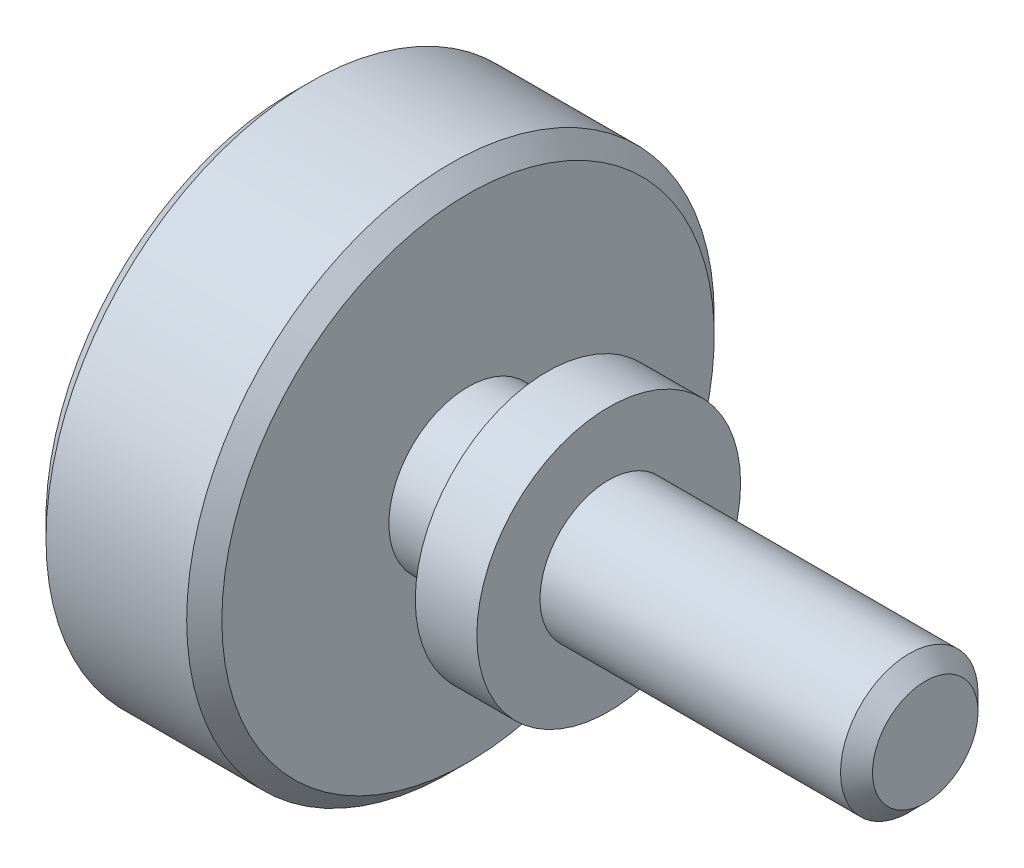
ISO-10303-21;
HEADER;
FILE_DESCRIPTION(('STEP AP214'),'2;1');
FILE_NAME('part.step','',(''),(''),'','','');
FILE_SCHEMA(('AUTOMOTIVE_DESIGN { 1 0 10303 214 1 1 1 1 }'));
ENDSEC;
DATA;
#1=APPLICATION_CONTEXT('core data for automotive mechanical design processes');
#2=APPLICATION_PROTOCOL_DEFINITION('international standard','automotive_design',2000,#1);
#3=PRODUCT_CONTEXT('',#1,'mechanical');
#4=PRODUCT('Part','Part','',(#3));
#5=PRODUCT_RELATED_PRODUCT_CATEGORY('part','',(#4));
#6=PRODUCT_DEFINITION_FORMATION('','',#4);
#7=PRODUCT_DEFINITION_CONTEXT('part definition',#1,'design');
#8=PRODUCT_DEFINITION('design','',#6,#7);
#9=PRODUCT_DEFINITION_SHAPE('','',#8);
#10=(LENGTH_UNIT() NAMED_UNIT(*) SI_UNIT(.MILLI.,.METRE.));
#11=(NAMED_UNIT(*) PLANE_ANGLE_UNIT() SI_UNIT($,.RADIAN.));
#12=(NAMED_UNIT(*) SI_UNIT($,.STERADIAN.) SOLID_ANGLE_UNIT());
#13=UNCERTAINTY_MEASURE_WITH_UNIT(LENGTH_MEASURE(1.E-05),#10,'distance_accuracy_value','');
#14=(GEOMETRIC_REPRESENTATION_CONTEXT(3) GLOBAL_UNCERTAINTY_ASSIGNED_CONTEXT((#13)) GLOBAL_UNIT_ASSIGNED_CONTEXT((#10,
#11,#12)) REPRESENTATION_CONTEXT('',''));
#15=CARTESIAN_POINT('',(0.,0.,0.));
#16=DIRECTION('',(0.,0.,1.));
#17=DIRECTION('',(1.,0.,0.));
#18=AXIS2_PLACEMENT_3D('',#15,#16,#17);
#19=CARTESIAN_POINT('',(18.,0.,0.));
#20=DIRECTION('',(1.,0.,0.));
#21=DIRECTION('',(0.,0.,-1.));
#22=AXIS2_PLACEMENT_3D('',#19,#20,#21);
#23=PLANE('',#22);
#24=CARTESIAN_POINT('',(17.9999999999723,0.,0.));
#25=DIRECTION('',(-1.,0.,0.));
#26=DIRECTION('',(0.,0.,1.));
#27=AXIS2_PLACEMENT_3D('',#24,#25,#26);
#28=CIRCLE('',#27,1.50000002980732);
#29=CARTESIAN_POINT('',(17.9999999999723,0.,1.50000002980732));
#30=VERTEX_POINT('',#29);
#31=EDGE_CURVE('E18',#30,#30,#28,.T.);
#32=ORIENTED_EDGE('',*,*,#31,.F.);
#33=EDGE_LOOP('',(#32));
#34=FACE_BOUND('',#33,.T.);
#35=ADVANCED_FACE('F15',(#34),#23,.T.);
#36=CARTESIAN_POINT('',(17.5460000297676,0.,0.));
#37=DIRECTION('',(-1.,0.,0.));
#38=DIRECTION('',(0.,0.,1.));
#39=AXIS2_PLACEMENT_3D('',#36,#37,#38);
#40=CONICAL_SURFACE('',#39,1.95399999995516,0.785398163334845);
#41=ORIENTED_EDGE('',*,*,#31,.T.);
#42=EDGE_LOOP('',(#41));
#43=FACE_BOUND('',#42,.T.);
#44=CARTESIAN_POINT('',(17.5460000298023,0.,0.));
#45=DIRECTION('',(1.,0.,0.));
#46=DIRECTION('',(0.,0.,-1.));
#47=AXIS2_PLACEMENT_3D('',#44,#45,#46);
#48=CIRCLE('',#47,1.954);
#49=CARTESIAN_POINT('',(17.5460000298023,0.,-1.954));
#50=VERTEX_POINT('',#49);
#51=EDGE_CURVE('E34',#50,#50,#48,.F.);
#52=ORIENTED_EDGE('',*,*,#51,.F.);
#53=EDGE_LOOP('',(#52));
#54=FACE_BOUND('',#53,.T.);
#55=ADVANCED_FACE('F64',(#43,#54),#40,.T.);
#56=CARTESIAN_POINT('',(9.,0.,0.));
#57=DIRECTION('',(1.,0.,0.));
#58=DIRECTION('',(0.,0.,-1.));
#59=AXIS2_PLACEMENT_3D('',#56,#57,#58);
#60=CYLINDRICAL_SURFACE('',#59,1.954);
#61=ORIENTED_EDGE('',*,*,#51,.T.);
#62=EDGE_LOOP('',(#61));
#63=FACE_BOUND('',#62,.T.);
#64=CARTESIAN_POINT('',(9.,0.,0.));
#65=DIRECTION('',(1.,0.,0.));
#66=DIRECTION('',(0.,0.,-1.));
#67=AXIS2_PLACEMENT_3D('',#64,#65,#66);
#68=CIRCLE('',#67,1.954);
#69=CARTESIAN_POINT('',(9.,0.,-1.954));
#70=VERTEX_POINT('',#69);
#71=EDGE_CURVE('E37',#70,#70,#68,.F.);
#72=ORIENTED_EDGE('',*,*,#71,.F.);
#73=EDGE_LOOP('',(#72));
#74=FACE_BOUND('',#73,.T.);
#75=ADVANCED_FACE('F62',(#63,#74),#60,.T.);
#76=CARTESIAN_POINT('',(9.,0.,0.));
#77=DIRECTION('',(1.,0.,0.));
#78=DIRECTION('',(0.,0.,-1.));
#79=AXIS2_PLACEMENT_3D('',#76,#77,#78);
#80=PLANE('',#79);
#81=ORIENTED_EDGE('',*,*,#71,.T.);
#82=EDGE_LOOP('',(#81));
#83=FACE_BOUND('',#82,.T.);
#84=CARTESIAN_POINT('',(9.,0.,0.));
#85=DIRECTION('',(1.,0.,0.));
#86=DIRECTION('',(0.,0.,-1.));
#87=AXIS2_PLACEMENT_3D('',#84,#85,#86);
#88=CIRCLE('',#87,3.75);
#89=CARTESIAN_POINT('',(9.,0.,-3.75));
#90=VERTEX_POINT('',#89);
#91=EDGE_CURVE('E54',#90,#90,#88,.F.);
#92=ORIENTED_EDGE('',*,*,#91,.F.);
#93=EDGE_LOOP('',(#92));
#94=FACE_BOUND('',#93,.T.);
#95=ADVANCED_FACE('F59',(#83,#94),#80,.T.);
#96=CARTESIAN_POINT('',(7.25,0.,0.));
#97=DIRECTION('',(1.,0.,0.));
#98=DIRECTION('',(0.,0.,-1.));
#99=AXIS2_PLACEMENT_3D('',#96,#97,#98);
#100=CYLINDRICAL_SURFACE('',#99,3.75);
#101=CARTESIAN_POINT('',(7.25,0.,0.));
#102=DIRECTION('',(1.,0.,0.));
#103=DIRECTION('',(0.,0.,-1.));
#104=AXIS2_PLACEMENT_3D('',#101,#102,#103);
#105=CIRCLE('',#104,3.75);
#106=CARTESIAN_POINT('',(7.25,0.,-3.75));
#107=VERTEX_POINT('',#106);
#108=EDGE_CURVE('E51',#107,#107,#105,.T.);
#109=ORIENTED_EDGE('',*,*,#108,.T.);
#110=EDGE_LOOP('',(#109));
#111=FACE_BOUND('',#110,.T.);
#112=ORIENTED_EDGE('',*,*,#91,.T.);
#113=EDGE_LOOP('',(#112));
#114=FACE_BOUND('',#113,.T.);
#115=ADVANCED_FACE('F72',(#111,#114),#100,.T.);
#116=CARTESIAN_POINT('',(7.25,0.,0.));
#117=DIRECTION('',(1.,0.,0.));
#118=DIRECTION('',(0.,0.,-1.));
#119=AXIS2_PLACEMENT_3D('',#116,#117,#118);
#120=PLANE('',#119);
#121=CARTESIAN_POINT('',(7.25,0.,0.));
#122=DIRECTION('',(1.,0.,0.));
#123=DIRECTION('',(0.,0.,-1.));
#124=AXIS2_PLACEMENT_3D('',#121,#122,#123);
#125=CIRCLE('',#124,2.25);
#126=CARTESIAN_POINT('',(7.25,0.,-2.25));
#127=VERTEX_POINT('',#126);
#128=EDGE_CURVE('E48',#127,#127,#125,.F.);
#129=ORIENTED_EDGE('',*,*,#128,.F.);
#130=EDGE_LOOP('',(#129));
#131=FACE_BOUND('',#130,.T.);
#132=ORIENTED_EDGE('',*,*,#108,.F.);
#133=EDGE_LOOP('',(#132));
#134=FACE_BOUND('',#133,.T.);
#135=ADVANCED_FACE('F101',(#131,#134),#120,.F.);
#136=CARTESIAN_POINT('',(5.,0.,0.));
#137=DIRECTION('',(1.,0.,0.));
#138=DIRECTION('',(0.,0.,-1.));
#139=AXIS2_PLACEMENT_3D('',#136,#137,#138);
#140=CYLINDRICAL_SURFACE('',#139,2.25);
#141=CARTESIAN_POINT('',(5.,0.,0.));
#142=DIRECTION('',(1.,0.,0.));
#143=DIRECTION('',(0.,0.,-1.));
#144=AXIS2_PLACEMENT_3D('',#141,#142,#143);
#145=CIRCLE('',#144,2.25);
#146=CARTESIAN_POINT('',(5.,0.,-2.25));
#147=VERTEX_POINT('',#146);
#148=EDGE_CURVE('E45',#147,#147,#145,.F.);
#149=ORIENTED_EDGE('',*,*,#148,.F.);
#150=EDGE_LOOP('',(#149));
#151=FACE_BOUND('',#150,.T.);
#152=ORIENTED_EDGE('',*,*,#128,.T.);
#153=EDGE_LOOP('',(#152));
#154=FACE_BOUND('',#153,.T.);
#155=ADVANCED_FACE('F97',(#151,#154),#140,.T.);
#156=CARTESIAN_POINT('',(0.,0.,0.));
#157=DIRECTION('',(1.,0.,0.));
#158=DIRECTION('',(0.,0.,-1.));
#159=AXIS2_PLACEMENT_3D('',#156,#157,#158);
#160=PLANE('',#159);
#161=CARTESIAN_POINT('',(0.,0.,0.));
#162=DIRECTION('',(1.,0.,0.));
#163=DIRECTION('',(0.,0.,-1.));
#164=AXIS2_PLACEMENT_3D('',#161,#162,#163);
#165=CIRCLE('',#164,7.);
#166=CARTESIAN_POINT('',(0.,0.,-7.));
#167=VERTEX_POINT('',#166);
#168=EDGE_CURVE('E42',#167,#167,#165,.T.);
#169=ORIENTED_EDGE('',*,*,#168,.F.);
#170=EDGE_LOOP('',(#169));
#171=FACE_BOUND('',#170,.T.);
#172=ADVANCED_FACE('F93',(#171),#160,.F.);
#173=CARTESIAN_POINT('',(5.,0.,0.));
#174=DIRECTION('',(1.,0.,0.));
#175=DIRECTION('',(0.,0.,-1.));
#176=AXIS2_PLACEMENT_3D('',#173,#174,#175);
#177=PLANE('',#176);
#178=ORIENTED_EDGE('',*,*,#148,.T.);
#179=EDGE_LOOP('',(#178));
#180=FACE_BOUND('',#179,.T.);
#181=CARTESIAN_POINT('',(5.,0.,0.));
#182=DIRECTION('',(-1.,0.,0.));
#183=DIRECTION('',(0.,0.,1.));
#184=AXIS2_PLACEMENT_3D('',#181,#182,#183);
#185=CIRCLE('',#184,7.);
#186=CARTESIAN_POINT('',(5.,0.,7.));
#187=VERTEX_POINT('',#186);
#188=EDGE_CURVE('E27',#187,#187,#185,.T.);
#189=ORIENTED_EDGE('',*,*,#188,.F.);
#190=EDGE_LOOP('',(#189));
#191=FACE_BOUND('',#190,.T.);
#192=ADVANCED_FACE('F89',(#180,#191),#177,.T.);
#193=CARTESIAN_POINT('',(0.5,0.,0.));
#194=DIRECTION('',(1.,0.,0.));
#195=DIRECTION('',(0.,0.,-1.));
#196=AXIS2_PLACEMENT_3D('',#193,#194,#195);
#197=CONICAL_SURFACE('',#196,7.5,0.785398163397449);
#198=CARTESIAN_POINT('',(0.5,0.,0.));
#199=DIRECTION('',(1.,0.,0.));
#200=DIRECTION('',(0.,0.,-1.));
#201=AXIS2_PLACEMENT_3D('',#198,#199,#200);
#202=CIRCLE('',#201,7.5);
#203=CARTESIAN_POINT('',(0.5,0.,-7.5));
#204=VERTEX_POINT('',#203);
#205=EDGE_CURVE('E22',#204,#204,#202,.T.);
#206=ORIENTED_EDGE('',*,*,#205,.F.);
#207=EDGE_LOOP('',(#206));
#208=FACE_BOUND('',#207,.T.);
#209=ORIENTED_EDGE('',*,*,#168,.T.);
#210=EDGE_LOOP('',(#209));
#211=FACE_BOUND('',#210,.T.);
#212=ADVANCED_FACE('F82',(#208,#211),#197,.T.);
#213=CARTESIAN_POINT('',(4.5,0.,0.));
#214=DIRECTION('',(-1.,0.,0.));
#215=DIRECTION('',(0.,0.,1.));
#216=AXIS2_PLACEMENT_3D('',#213,#214,#215);
#217=CONICAL_SURFACE('',#216,7.5,0.785398163397449);
#218=ORIENTED_EDGE('',*,*,#188,.T.);
#219=EDGE_LOOP('',(#218));
#220=FACE_BOUND('',#219,.T.);
#221=CARTESIAN_POINT('',(4.5,0.,0.));
#222=DIRECTION('',(1.,0.,0.));
#223=DIRECTION('',(0.,0.,-1.));
#224=AXIS2_PLACEMENT_3D('',#221,#222,#223);
#225=CIRCLE('',#224,7.5);
#226=CARTESIAN_POINT('',(4.5,0.,-7.5));
#227=VERTEX_POINT('',#226);
#228=EDGE_CURVE('E10',#227,#227,#225,.F.);
#229=ORIENTED_EDGE('',*,*,#228,.F.);
#230=EDGE_LOOP('',(#229));
#231=FACE_BOUND('',#230,.T.);
#232=ADVANCED_FACE('F77',(#220,#231),#217,.T.);
#233=CARTESIAN_POINT('',(0.,0.,0.));
#234=DIRECTION('',(1.,0.,0.));
#235=DIRECTION('',(0.,0.,-1.));
#236=AXIS2_PLACEMENT_3D('',#233,#234,#235);
#237=CYLINDRICAL_SURFACE('',#236,7.5);
#238=ORIENTED_EDGE('',*,*,#228,.T.);
#239=EDGE_LOOP('',(#238));
#240=FACE_BOUND('',#239,.T.);
#241=ORIENTED_EDGE('',*,*,#205,.T.);
#242=EDGE_LOOP('',(#241));
#243=FACE_BOUND('',#242,.T.);
#244=ADVANCED_FACE('F75',(#240,#243),#237,.T.);
#245=CLOSED_SHELL('',(#35,#55,#75,#95,#115,#135,#155,#172,#192,#212,#232,#244));
#246=MANIFOLD_SOLID_BREP('B1',#245);
#247=ADVANCED_BREP_SHAPE_REPRESENTATION('',(#18,#246),#14);
#248=SHAPE_DEFINITION_REPRESENTATION(#9,#247);
ENDSEC;
END-ISO-10303-21;
